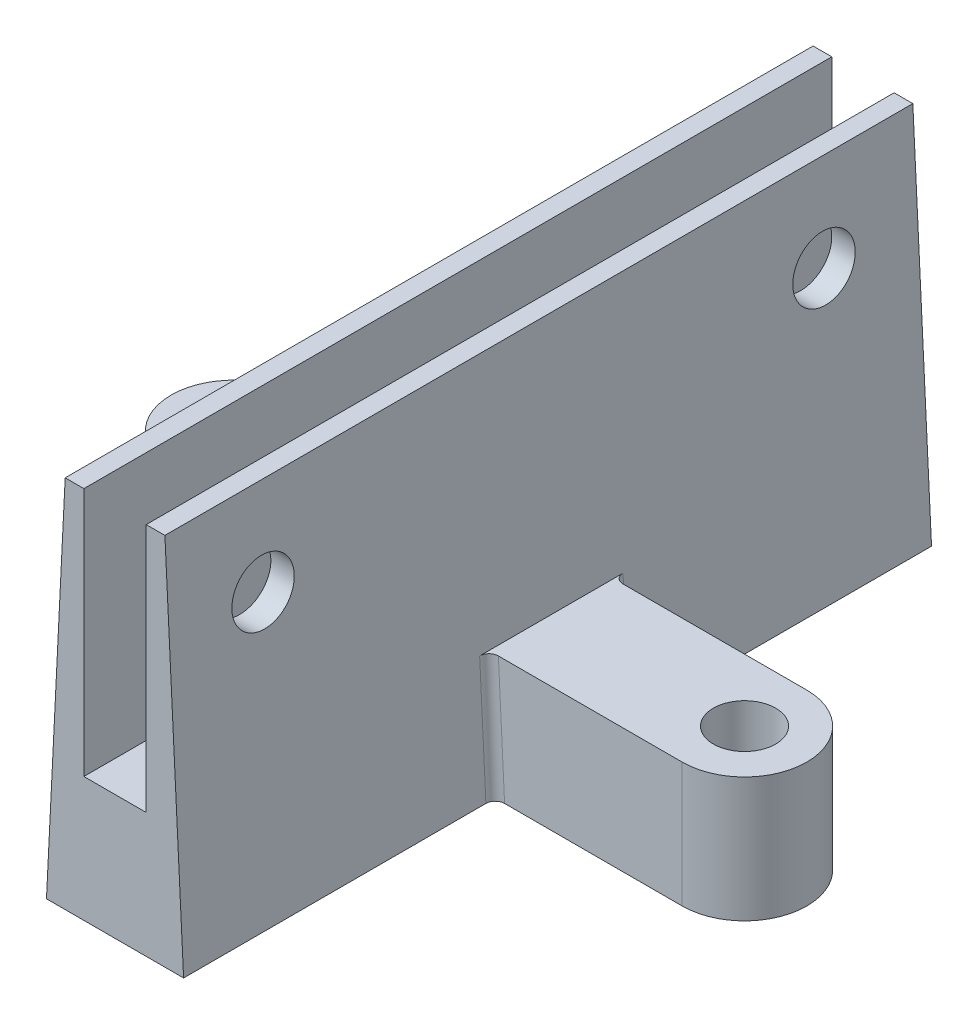
ISO-10303-21;
HEADER;
FILE_DESCRIPTION(('STEP AP214'),'2;1');
FILE_NAME('part.step','',(''),(''),'','','');
FILE_SCHEMA(('AUTOMOTIVE_DESIGN { 1 0 10303 214 1 1 1 1 }'));
ENDSEC;
DATA;
#1=APPLICATION_CONTEXT('core data for automotive mechanical design processes');
#2=APPLICATION_PROTOCOL_DEFINITION('international standard','automotive_design',2000,#1);
#3=PRODUCT_CONTEXT('',#1,'mechanical');
#4=PRODUCT('Part','Part','',(#3));
#5=PRODUCT_RELATED_PRODUCT_CATEGORY('part','',(#4));
#6=PRODUCT_DEFINITION_FORMATION('','',#4);
#7=PRODUCT_DEFINITION_CONTEXT('part definition',#1,'design');
#8=PRODUCT_DEFINITION('design','',#6,#7);
#9=PRODUCT_DEFINITION_SHAPE('','',#8);
#10=(LENGTH_UNIT() NAMED_UNIT(*) SI_UNIT(.MILLI.,.METRE.));
#11=(NAMED_UNIT(*) PLANE_ANGLE_UNIT() SI_UNIT($,.RADIAN.));
#12=(NAMED_UNIT(*) SI_UNIT($,.STERADIAN.) SOLID_ANGLE_UNIT());
#13=UNCERTAINTY_MEASURE_WITH_UNIT(LENGTH_MEASURE(1.E-05),#10,'distance_accuracy_value','');
#14=(GEOMETRIC_REPRESENTATION_CONTEXT(3) GLOBAL_UNCERTAINTY_ASSIGNED_CONTEXT((#13)) GLOBAL_UNIT_ASSIGNED_CONTEXT((#10,
#11,#12)) REPRESENTATION_CONTEXT('',''));
#15=CARTESIAN_POINT('',(0.,0.,0.));
#16=DIRECTION('',(0.,0.,1.));
#17=DIRECTION('',(1.,0.,0.));
#18=AXIS2_PLACEMENT_3D('',#15,#16,#17);
#19=CARTESIAN_POINT('',(0.,40.,-120.));
#20=DIRECTION('',(1.,0.,0.));
#21=DIRECTION('',(0.,0.,-1.));
#22=AXIS2_PLACEMENT_3D('',#19,#20,#21);
#23=PLANE('',#22);
#24=CARTESIAN_POINT('',(0.,25.,-15.));
#25=DIRECTION('',(1.,0.,0.));
#26=DIRECTION('',(0.,0.,-1.));
#27=AXIS2_PLACEMENT_3D('',#24,#25,#26);
#28=CIRCLE('',#27,5.);
#29=CARTESIAN_POINT('',(0.,25.,-20.));
#30=VERTEX_POINT('',#29);
#31=EDGE_CURVE('E431',#30,#30,#28,.F.);
#32=ORIENTED_EDGE('',*,*,#31,.T.);
#33=EDGE_LOOP('',(#32));
#34=FACE_BOUND('',#33,.T.);
#35=CARTESIAN_POINT('',(0.,25.,-105.));
#36=DIRECTION('',(1.,0.,0.));
#37=DIRECTION('',(0.,0.,-1.));
#38=AXIS2_PLACEMENT_3D('',#35,#36,#37);
#39=CIRCLE('',#38,5.);
#40=CARTESIAN_POINT('',(0.,25.,-110.));
#41=VERTEX_POINT('',#40);
#42=EDGE_CURVE('E417',#41,#41,#39,.F.);
#43=ORIENTED_EDGE('',*,*,#42,.T.);
#44=EDGE_LOOP('',(#43));
#45=FACE_BOUND('',#44,.T.);
#46=DIRECTION('',(0.,1.,0.));
#47=VECTOR('',#46,1.);
#48=CARTESIAN_POINT('',(0.,40.,0.));
#49=LINE('',#48,#47);
#50=CARTESIAN_POINT('',(0.,0.,0.));
#51=VERTEX_POINT('',#50);
#52=CARTESIAN_POINT('',(0.,40.,0.));
#53=VERTEX_POINT('',#52);
#54=EDGE_CURVE('E255',#51,#53,#49,.T.);
#55=ORIENTED_EDGE('',*,*,#54,.F.);
#56=DIRECTION('',(0.,0.,1.));
#57=VECTOR('',#56,1.);
#58=CARTESIAN_POINT('',(0.,0.,-120.));
#59=LINE('',#58,#57);
#60=CARTESIAN_POINT('',(0.,0.,-120.));
#61=VERTEX_POINT('',#60);
#62=EDGE_CURVE('E323',#61,#51,#59,.T.);
#63=ORIENTED_EDGE('',*,*,#62,.F.);
#64=DIRECTION('',(0.,1.,0.));
#65=VECTOR('',#64,1.);
#66=CARTESIAN_POINT('',(0.,40.,-120.));
#67=LINE('',#66,#65);
#68=CARTESIAN_POINT('',(0.,40.,-120.));
#69=VERTEX_POINT('',#68);
#70=EDGE_CURVE('E259',#61,#69,#67,.T.);
#71=ORIENTED_EDGE('',*,*,#70,.T.);
#72=DIRECTION('',(0.,0.,1.));
#73=VECTOR('',#72,1.);
#74=CARTESIAN_POINT('',(0.,40.,-120.));
#75=LINE('',#74,#73);
#76=EDGE_CURVE('E292',#69,#53,#75,.T.);
#77=ORIENTED_EDGE('',*,*,#76,.T.);
#78=EDGE_LOOP('',(#55,#63,#71,#77));
#79=FACE_BOUND('',#78,.T.);
#80=ADVANCED_FACE('F38',(#34,#45,#79),#23,.T.);
#81=CARTESIAN_POINT('',(0.,0.,-120.));
#82=DIRECTION('',(0.,1.,0.));
#83=DIRECTION('',(0.,0.,1.));
#84=AXIS2_PLACEMENT_3D('',#81,#82,#83);
#85=PLANE('',#84);
#86=DIRECTION('',(-1.,0.,0.));
#87=VECTOR('',#86,1.);
#88=CARTESIAN_POINT('',(0.,0.,0.));
#89=LINE('',#88,#87);
#90=CARTESIAN_POINT('',(10.,0.,0.));
#91=VERTEX_POINT('',#90);
#92=EDGE_CURVE('E264',#91,#51,#89,.T.);
#93=ORIENTED_EDGE('',*,*,#92,.F.);
#94=DIRECTION('',(0.,0.,1.));
#95=VECTOR('',#94,1.);
#96=CARTESIAN_POINT('',(10.,0.,-120.));
#97=LINE('',#96,#95);
#98=CARTESIAN_POINT('',(10.,0.,-120.));
#99=VERTEX_POINT('',#98);
#100=EDGE_CURVE('E327',#99,#91,#97,.T.);
#101=ORIENTED_EDGE('',*,*,#100,.F.);
#102=DIRECTION('',(-1.,0.,0.));
#103=VECTOR('',#102,1.);
#104=CARTESIAN_POINT('',(0.,0.,-120.));
#105=LINE('',#104,#103);
#106=EDGE_CURVE('E288',#99,#61,#105,.T.);
#107=ORIENTED_EDGE('',*,*,#106,.T.);
#108=ORIENTED_EDGE('',*,*,#62,.T.);
#109=EDGE_LOOP('',(#93,#101,#107,#108));
#110=FACE_BOUND('',#109,.T.);
#111=ADVANCED_FACE('F464',(#110),#85,.T.);
#112=CARTESIAN_POINT('',(10.,0.,-120.));
#113=DIRECTION('',(-1.,0.,0.));
#114=DIRECTION('',(0.,0.,1.));
#115=AXIS2_PLACEMENT_3D('',#112,#113,#114);
#116=PLANE('',#115);
#117=CARTESIAN_POINT('',(10.,25.,-15.));
#118=DIRECTION('',(-1.,0.,0.));
#119=DIRECTION('',(0.,0.,1.));
#120=AXIS2_PLACEMENT_3D('',#117,#118,#119);
#121=CIRCLE('',#120,5.);
#122=CARTESIAN_POINT('',(10.,25.,-10.));
#123=VERTEX_POINT('',#122);
#124=EDGE_CURVE('E427',#123,#123,#121,.F.);
#125=ORIENTED_EDGE('',*,*,#124,.T.);
#126=EDGE_LOOP('',(#125));
#127=FACE_BOUND('',#126,.T.);
#128=CARTESIAN_POINT('',(10.,25.,-105.));
#129=DIRECTION('',(-1.,0.,0.));
#130=DIRECTION('',(0.,0.,1.));
#131=AXIS2_PLACEMENT_3D('',#128,#129,#130);
#132=CIRCLE('',#131,5.);
#133=CARTESIAN_POINT('',(10.,25.,-100.));
#134=VERTEX_POINT('',#133);
#135=EDGE_CURVE('E411',#134,#134,#132,.F.);
#136=ORIENTED_EDGE('',*,*,#135,.T.);
#137=EDGE_LOOP('',(#136));
#138=FACE_BOUND('',#137,.T.);
#139=DIRECTION('',(0.,-1.,0.));
#140=VECTOR('',#139,1.);
#141=CARTESIAN_POINT('',(10.,0.,0.));
#142=LINE('',#141,#140);
#143=CARTESIAN_POINT('',(10.,40.,0.));
#144=VERTEX_POINT('',#143);
#145=EDGE_CURVE('E316',#144,#91,#142,.T.);
#146=ORIENTED_EDGE('',*,*,#145,.F.);
#147=DIRECTION('',(0.,0.,1.));
#148=VECTOR('',#147,1.);
#149=CARTESIAN_POINT('',(10.,40.,-120.));
#150=LINE('',#149,#148);
#151=CARTESIAN_POINT('',(10.,40.,-120.));
#152=VERTEX_POINT('',#151);
#153=EDGE_CURVE('E330',#152,#144,#150,.T.);
#154=ORIENTED_EDGE('',*,*,#153,.F.);
#155=DIRECTION('',(0.,-1.,0.));
#156=VECTOR('',#155,1.);
#157=CARTESIAN_POINT('',(10.,0.,-120.));
#158=LINE('',#157,#156);
#159=EDGE_CURVE('E284',#152,#99,#158,.T.);
#160=ORIENTED_EDGE('',*,*,#159,.T.);
#161=ORIENTED_EDGE('',*,*,#100,.T.);
#162=EDGE_LOOP('',(#146,#154,#160,#161));
#163=FACE_BOUND('',#162,.T.);
#164=ADVANCED_FACE('F472',(#127,#138,#163),#116,.T.);
#165=CARTESIAN_POINT('',(10.,40.,-120.));
#166=DIRECTION('',(0.,1.,0.));
#167=DIRECTION('',(0.,0.,1.));
#168=AXIS2_PLACEMENT_3D('',#165,#166,#167);
#169=PLANE('',#168);
#170=DIRECTION('',(-1.,0.,0.));
#171=VECTOR('',#170,1.);
#172=CARTESIAN_POINT('',(10.,40.,0.));
#173=LINE('',#172,#171);
#174=CARTESIAN_POINT('',(13.,40.,0.));
#175=VERTEX_POINT('',#174);
#176=EDGE_CURVE('E312',#175,#144,#173,.T.);
#177=ORIENTED_EDGE('',*,*,#176,.F.);
#178=DIRECTION('',(0.,0.,1.));
#179=VECTOR('',#178,1.);
#180=CARTESIAN_POINT('',(13.,40.,-120.));
#181=LINE('',#180,#179);
#182=CARTESIAN_POINT('',(13.,40.,-120.));
#183=VERTEX_POINT('',#182);
#184=EDGE_CURVE('E333',#183,#175,#181,.T.);
#185=ORIENTED_EDGE('',*,*,#184,.F.);
#186=DIRECTION('',(-1.,0.,0.));
#187=VECTOR('',#186,1.);
#188=CARTESIAN_POINT('',(10.,40.,-120.));
#189=LINE('',#188,#187);
#190=EDGE_CURVE('E280',#183,#152,#189,.T.);
#191=ORIENTED_EDGE('',*,*,#190,.T.);
#192=ORIENTED_EDGE('',*,*,#153,.T.);
#193=EDGE_LOOP('',(#177,#185,#191,#192));
#194=FACE_BOUND('',#193,.T.);
#195=ADVANCED_FACE('F459',(#194),#169,.T.);
#196=CARTESIAN_POINT('',(16.,-20.,-120.));
#197=DIRECTION('',(0.998752338877845,0.0499376169438923,0.));
#198=DIRECTION('',(-0.0499376169438923,0.998752338877845,0.));
#199=AXIS2_PLACEMENT_3D('',#196,#197,#198);
#200=PLANE('',#199);
#201=CARTESIAN_POINT('',(13.75,25.,-15.));
#202=DIRECTION('',(0.998752338877845,0.0499376169438923,0.));
#203=DIRECTION('',(-0.0499376169438923,0.998752338877845,0.));
#204=AXIS2_PLACEMENT_3D('',#201,#202,#203);
#205=ELLIPSE('',#204,5.0062460986252,5.);
#206=CARTESIAN_POINT('',(13.5,30.,-15.));
#207=VERTEX_POINT('',#206);
#208=EDGE_CURVE('E423',#207,#207,#205,.F.);
#209=ORIENTED_EDGE('',*,*,#208,.T.);
#210=EDGE_LOOP('',(#209));
#211=FACE_BOUND('',#210,.T.);
#212=CARTESIAN_POINT('',(13.75,25.,-105.));
#213=DIRECTION('',(0.998752338877845,0.0499376169438923,0.));
#214=DIRECTION('',(-0.0499376169438923,0.998752338877845,0.));
#215=AXIS2_PLACEMENT_3D('',#212,#213,#214);
#216=ELLIPSE('',#215,5.0062460986252,5.);
#217=CARTESIAN_POINT('',(13.5,30.,-105.));
#218=VERTEX_POINT('',#217);
#219=EDGE_CURVE('E406',#218,#218,#216,.F.);
#220=ORIENTED_EDGE('',*,*,#219,.T.);
#221=EDGE_LOOP('',(#220));
#222=FACE_BOUND('',#221,.T.);
#223=DIRECTION('',(0.,0.,-1.));
#224=VECTOR('',#223,1.);
#225=CARTESIAN_POINT('',(15.,0.,-120.));
#226=LINE('',#225,#224);
#227=CARTESIAN_POINT('',(15.,0.,-48.5));
#228=VERTEX_POINT('',#227);
#229=CARTESIAN_POINT('',(15.,0.,-71.5));
#230=VERTEX_POINT('',#229);
#231=EDGE_CURVE('E326',#228,#230,#226,.T.);
#232=ORIENTED_EDGE('',*,*,#231,.T.);
#233=DIRECTION('',(-0.0499376169438923,0.998752338877845,0.));
#234=VECTOR('',#233,1.);
#235=CARTESIAN_POINT('',(16.,-20.,-71.5));
#236=LINE('',#235,#234);
#237=CARTESIAN_POINT('',(16.,-20.,-71.5));
#238=VERTEX_POINT('',#237);
#239=EDGE_CURVE('E377',#230,#238,#236,.F.);
#240=ORIENTED_EDGE('',*,*,#239,.T.);
#241=DIRECTION('',(0.,0.,1.));
#242=VECTOR('',#241,1.);
#243=CARTESIAN_POINT('',(16.,-20.,-120.));
#244=LINE('',#243,#242);
#245=CARTESIAN_POINT('',(16.,-20.,-120.));
#246=VERTEX_POINT('',#245);
#247=EDGE_CURVE('E336',#246,#238,#244,.T.);
#248=ORIENTED_EDGE('',*,*,#247,.F.);
#249=DIRECTION('',(-0.0499376169438923,0.998752338877845,0.));
#250=VECTOR('',#249,1.);
#251=CARTESIAN_POINT('',(16.,-20.,-120.));
#252=LINE('',#251,#250);
#253=EDGE_CURVE('E276',#246,#183,#252,.T.);
#254=ORIENTED_EDGE('',*,*,#253,.T.);
#255=ORIENTED_EDGE('',*,*,#184,.T.);
#256=DIRECTION('',(-0.0499376169438923,0.998752338877845,0.));
#257=VECTOR('',#256,1.);
#258=CARTESIAN_POINT('',(16.,-20.,0.));
#259=LINE('',#258,#257);
#260=CARTESIAN_POINT('',(16.,-20.,0.));
#261=VERTEX_POINT('',#260);
#262=EDGE_CURVE('E308',#261,#175,#259,.T.);
#263=ORIENTED_EDGE('',*,*,#262,.F.);
#264=CARTESIAN_POINT('',(16.,-20.,-48.5));
#265=VERTEX_POINT('',#264);
#266=EDGE_CURVE('E340',#265,#261,#244,.T.);
#267=ORIENTED_EDGE('',*,*,#266,.F.);
#268=DIRECTION('',(0.0499376169438923,-0.998752338877845,0.));
#269=VECTOR('',#268,1.);
#270=CARTESIAN_POINT('',(15.,0.,-48.5));
#271=LINE('',#270,#269);
#272=EDGE_CURVE('E373',#265,#228,#271,.F.);
#273=ORIENTED_EDGE('',*,*,#272,.T.);
#274=EDGE_LOOP('',(#232,#240,#248,#254,#255,#263,#267,#273));
#275=FACE_BOUND('',#274,.T.);
#276=ADVANCED_FACE('F447',(#211,#222,#275),#200,.T.);
#277=CARTESIAN_POINT('',(-6.,-20.,-120.));
#278=DIRECTION('',(0.,-1.,0.));
#279=DIRECTION('',(0.,0.,-1.));
#280=AXIS2_PLACEMENT_3D('',#277,#278,#279);
#281=PLANE('',#280);
#282=DIRECTION('',(1.,0.,0.));
#283=VECTOR('',#282,1.);
#284=CARTESIAN_POINT('',(-6.,-20.,-70.));
#285=LINE('',#284,#283);
#286=CARTESIAN_POINT('',(-36.,-20.,-70.));
#287=VERTEX_POINT('',#286);
#288=CARTESIAN_POINT('',(-7.50187382958756,-20.,-70.));
#289=VERTEX_POINT('',#288);
#290=EDGE_CURVE('E190',#287,#289,#285,.T.);
#291=ORIENTED_EDGE('',*,*,#290,.T.);
#292=CARTESIAN_POINT('',(-7.50187382958756,-20.,-71.5));
#293=DIRECTION('',(0.,-1.,0.));
#294=DIRECTION('',(1.,0.,0.));
#295=AXIS2_PLACEMENT_3D('',#292,#293,#294);
#296=ELLIPSE('',#295,1.50187382958756,1.5);
#297=CARTESIAN_POINT('',(-6.,-20.,-71.5));
#298=VERTEX_POINT('',#297);
#299=EDGE_CURVE('E389',#289,#298,#296,.F.);
#300=ORIENTED_EDGE('',*,*,#299,.T.);
#301=DIRECTION('',(0.,0.,1.));
#302=VECTOR('',#301,1.);
#303=CARTESIAN_POINT('',(-6.,-20.,-120.));
#304=LINE('',#303,#302);
#305=CARTESIAN_POINT('',(-6.,-20.,-120.));
#306=VERTEX_POINT('',#305);
#307=EDGE_CURVE('E341',#306,#298,#304,.T.);
#308=ORIENTED_EDGE('',*,*,#307,.F.);
#309=DIRECTION('',(1.,0.,0.));
#310=VECTOR('',#309,1.);
#311=CARTESIAN_POINT('',(-6.,-20.,-120.));
#312=LINE('',#311,#310);
#313=EDGE_CURVE('E272',#306,#246,#312,.T.);
#314=ORIENTED_EDGE('',*,*,#313,.T.);
#315=ORIENTED_EDGE('',*,*,#247,.T.);
#316=CARTESIAN_POINT('',(17.5018738295876,-20.,-71.5));
#317=DIRECTION('',(0.,-1.,0.));
#318=DIRECTION('',(1.,0.,0.));
#319=AXIS2_PLACEMENT_3D('',#316,#317,#318);
#320=ELLIPSE('',#319,1.50187382958756,1.5);
#321=CARTESIAN_POINT('',(17.5018738295876,-20.,-70.));
#322=VERTEX_POINT('',#321);
#323=EDGE_CURVE('E399',#238,#322,#320,.F.);
#324=ORIENTED_EDGE('',*,*,#323,.T.);
#325=DIRECTION('',(1.,0.,0.));
#326=VECTOR('',#325,1.);
#327=CARTESIAN_POINT('',(16.,-20.,-70.));
#328=LINE('',#327,#326);
#329=CARTESIAN_POINT('',(46.,-20.,-70.));
#330=VERTEX_POINT('',#329);
#331=EDGE_CURVE('E227',#322,#330,#328,.T.);
#332=ORIENTED_EDGE('',*,*,#331,.T.);
#333=CARTESIAN_POINT('',(46.,-20.,-60.));
#334=DIRECTION('',(0.,-1.,0.));
#335=DIRECTION('',(0.,0.,-1.));
#336=AXIS2_PLACEMENT_3D('',#333,#334,#335);
#337=CIRCLE('',#336,9.99999999999999);
#338=CARTESIAN_POINT('',(46.,-20.,-50.));
#339=VERTEX_POINT('',#338);
#340=EDGE_CURVE('E245',#330,#339,#337,.T.);
#341=ORIENTED_EDGE('',*,*,#340,.T.);
#342=DIRECTION('',(-1.,0.,0.));
#343=VECTOR('',#342,1.);
#344=CARTESIAN_POINT('',(16.,-20.,-50.));
#345=LINE('',#344,#343);
#346=CARTESIAN_POINT('',(17.5018738295876,-20.,-50.));
#347=VERTEX_POINT('',#346);
#348=EDGE_CURVE('E235',#339,#347,#345,.T.);
#349=ORIENTED_EDGE('',*,*,#348,.T.);
#350=CARTESIAN_POINT('',(17.5018738295876,-20.,-48.5));
#351=DIRECTION('',(0.,-1.,0.));
#352=DIRECTION('',(-1.,0.,0.));
#353=AXIS2_PLACEMENT_3D('',#350,#351,#352);
#354=ELLIPSE('',#353,1.50187382958756,1.5);
#355=EDGE_CURVE('E48',#347,#265,#354,.F.);
#356=ORIENTED_EDGE('',*,*,#355,.T.);
#357=ORIENTED_EDGE('',*,*,#266,.T.);
#358=DIRECTION('',(1.,0.,0.));
#359=VECTOR('',#358,1.);
#360=CARTESIAN_POINT('',(-6.,-20.,0.));
#361=LINE('',#360,#359);
#362=CARTESIAN_POINT('',(-6.,-20.,0.));
#363=VERTEX_POINT('',#362);
#364=EDGE_CURVE('E304',#363,#261,#361,.T.);
#365=ORIENTED_EDGE('',*,*,#364,.F.);
#366=CARTESIAN_POINT('',(-6.,-20.,-48.5));
#367=VERTEX_POINT('',#366);
#368=EDGE_CURVE('E345',#367,#363,#304,.T.);
#369=ORIENTED_EDGE('',*,*,#368,.F.);
#370=CARTESIAN_POINT('',(-7.50187382958756,-20.,-48.5));
#371=DIRECTION('',(0.,-1.,0.));
#372=DIRECTION('',(-1.,0.,0.));
#373=AXIS2_PLACEMENT_3D('',#370,#371,#372);
#374=ELLIPSE('',#373,1.50187382958756,1.5);
#375=CARTESIAN_POINT('',(-7.50187382958756,-20.,-50.));
#376=VERTEX_POINT('',#375);
#377=EDGE_CURVE('E386',#367,#376,#374,.F.);
#378=ORIENTED_EDGE('',*,*,#377,.T.);
#379=DIRECTION('',(-1.,0.,0.));
#380=VECTOR('',#379,1.);
#381=CARTESIAN_POINT('',(-6.,-20.,-50.));
#382=LINE('',#381,#380);
#383=CARTESIAN_POINT('',(-36.,-20.,-50.));
#384=VERTEX_POINT('',#383);
#385=EDGE_CURVE('E211',#376,#384,#382,.T.);
#386=ORIENTED_EDGE('',*,*,#385,.T.);
#387=CARTESIAN_POINT('',(-36.,-20.,-60.));
#388=DIRECTION('',(0.,-1.,0.));
#389=DIRECTION('',(0.,0.,1.));
#390=AXIS2_PLACEMENT_3D('',#387,#388,#389);
#391=CIRCLE('',#390,9.99999999999999);
#392=EDGE_CURVE('E197',#384,#287,#391,.T.);
#393=ORIENTED_EDGE('',*,*,#392,.T.);
#394=EDGE_LOOP('',(#291,#300,#308,#314,#315,#324,#332,#341,#349,#356,#357,#365,#369,#378,#386,#393));
#395=FACE_BOUND('',#394,.T.);
#396=CARTESIAN_POINT('',(46.,-20.,-60.));
#397=DIRECTION('',(0.,-1.,0.));
#398=DIRECTION('',(0.,0.,-1.));
#399=AXIS2_PLACEMENT_3D('',#396,#397,#398);
#400=CIRCLE('',#399,5.);
#401=CARTESIAN_POINT('',(46.,-20.,-65.));
#402=VERTEX_POINT('',#401);
#403=EDGE_CURVE('E221',#402,#402,#400,.T.);
#404=ORIENTED_EDGE('',*,*,#403,.F.);
#405=EDGE_LOOP('',(#404));
#406=FACE_BOUND('',#405,.T.);
#407=CARTESIAN_POINT('',(-36.,-20.,-60.));
#408=DIRECTION('',(0.,-1.,0.));
#409=DIRECTION('',(0.,0.,-1.));
#410=AXIS2_PLACEMENT_3D('',#407,#408,#409);
#411=CIRCLE('',#410,5.);
#412=CARTESIAN_POINT('',(-36.,-20.,-65.));
#413=VERTEX_POINT('',#412);
#414=EDGE_CURVE('E435',#413,#413,#411,.T.);
#415=ORIENTED_EDGE('',*,*,#414,.F.);
#416=EDGE_LOOP('',(#415));
#417=FACE_BOUND('',#416,.T.);
#418=ADVANCED_FACE('F444',(#395,#406,#417),#281,.T.);
#419=CARTESIAN_POINT('',(-6.,-20.,-120.));
#420=DIRECTION('',(-0.998752338877845,0.0499376169438922,0.));
#421=DIRECTION('',(-0.0499376169438922,-0.998752338877845,0.));
#422=AXIS2_PLACEMENT_3D('',#419,#420,#421);
#423=PLANE('',#422);
#424=CARTESIAN_POINT('',(-3.75,25.,-15.));
#425=DIRECTION('',(-0.998752338877845,0.0499376169438922,0.));
#426=DIRECTION('',(-0.0499376169438922,-0.998752338877845,0.));
#427=AXIS2_PLACEMENT_3D('',#424,#425,#426);
#428=ELLIPSE('',#427,5.0062460986252,5.);
#429=CARTESIAN_POINT('',(-4.,20.,-15.));
#430=VERTEX_POINT('',#429);
#431=EDGE_CURVE('E42',#430,#430,#428,.F.);
#432=ORIENTED_EDGE('',*,*,#431,.T.);
#433=EDGE_LOOP('',(#432));
#434=FACE_BOUND('',#433,.T.);
#435=CARTESIAN_POINT('',(-3.75,25.,-105.));
#436=DIRECTION('',(-0.998752338877845,0.0499376169438922,0.));
#437=DIRECTION('',(-0.0499376169438922,-0.998752338877845,0.));
#438=AXIS2_PLACEMENT_3D('',#435,#436,#437);
#439=ELLIPSE('',#438,5.0062460986252,5.);
#440=CARTESIAN_POINT('',(-4.,20.,-105.));
#441=VERTEX_POINT('',#440);
#442=EDGE_CURVE('E403',#441,#441,#439,.F.);
#443=ORIENTED_EDGE('',*,*,#442,.T.);
#444=EDGE_LOOP('',(#443));
#445=FACE_BOUND('',#444,.T.);
#446=DIRECTION('',(0.,0.,-1.));
#447=VECTOR('',#446,1.);
#448=CARTESIAN_POINT('',(-5.,0.,-120.));
#449=LINE('',#448,#447);
#450=CARTESIAN_POINT('',(-5.,0.,-48.5));
#451=VERTEX_POINT('',#450);
#452=CARTESIAN_POINT('',(-5.,0.,-71.5));
#453=VERTEX_POINT('',#452);
#454=EDGE_CURVE('E353',#451,#453,#449,.T.);
#455=ORIENTED_EDGE('',*,*,#454,.F.);
#456=DIRECTION('',(0.0499376169438922,0.998752338877845,0.));
#457=VECTOR('',#456,1.);
#458=CARTESIAN_POINT('',(-6.,-20.,-48.5));
#459=LINE('',#458,#457);
#460=EDGE_CURVE('E362',#451,#367,#459,.F.);
#461=ORIENTED_EDGE('',*,*,#460,.T.);
#462=ORIENTED_EDGE('',*,*,#368,.T.);
#463=DIRECTION('',(-0.0499376169438922,-0.998752338877845,0.));
#464=VECTOR('',#463,1.);
#465=CARTESIAN_POINT('',(-6.,-20.,0.));
#466=LINE('',#465,#464);
#467=CARTESIAN_POINT('',(-3.,40.,0.));
#468=VERTEX_POINT('',#467);
#469=EDGE_CURVE('E300',#468,#363,#466,.T.);
#470=ORIENTED_EDGE('',*,*,#469,.F.);
#471=DIRECTION('',(0.,0.,1.));
#472=VECTOR('',#471,1.);
#473=CARTESIAN_POINT('',(-3.,40.,-120.));
#474=LINE('',#473,#472);
#475=CARTESIAN_POINT('',(-3.,40.,-120.));
#476=VERTEX_POINT('',#475);
#477=EDGE_CURVE('E346',#476,#468,#474,.T.);
#478=ORIENTED_EDGE('',*,*,#477,.F.);
#479=DIRECTION('',(-0.0499376169438922,-0.998752338877845,0.));
#480=VECTOR('',#479,1.);
#481=CARTESIAN_POINT('',(-6.,-20.,-120.));
#482=LINE('',#481,#480);
#483=EDGE_CURVE('E268',#476,#306,#482,.T.);
#484=ORIENTED_EDGE('',*,*,#483,.T.);
#485=ORIENTED_EDGE('',*,*,#307,.T.);
#486=DIRECTION('',(-0.0499376169438922,-0.998752338877845,0.));
#487=VECTOR('',#486,1.);
#488=CARTESIAN_POINT('',(-5.,0.,-71.5));
#489=LINE('',#488,#487);
#490=EDGE_CURVE('E358',#298,#453,#489,.F.);
#491=ORIENTED_EDGE('',*,*,#490,.T.);
#492=EDGE_LOOP('',(#455,#461,#462,#470,#478,#484,#485,#491));
#493=FACE_BOUND('',#492,.T.);
#494=ADVANCED_FACE('F446',(#434,#445,#493),#423,.T.);
#495=CARTESIAN_POINT('',(-3.,40.,-120.));
#496=DIRECTION('',(0.,1.,0.));
#497=DIRECTION('',(-1.,0.,0.));
#498=AXIS2_PLACEMENT_3D('',#495,#496,#497);
#499=PLANE('',#498);
#500=DIRECTION('',(-1.,0.,0.));
#501=VECTOR('',#500,1.);
#502=CARTESIAN_POINT('',(-3.,40.,0.));
#503=LINE('',#502,#501);
#504=EDGE_CURVE('E296',#53,#468,#503,.T.);
#505=ORIENTED_EDGE('',*,*,#504,.F.);
#506=ORIENTED_EDGE('',*,*,#76,.F.);
#507=DIRECTION('',(-1.,0.,0.));
#508=VECTOR('',#507,1.);
#509=CARTESIAN_POINT('',(-3.,40.,-120.));
#510=LINE('',#509,#508);
#511=EDGE_CURVE('E263',#69,#476,#510,.T.);
#512=ORIENTED_EDGE('',*,*,#511,.T.);
#513=ORIENTED_EDGE('',*,*,#477,.T.);
#514=EDGE_LOOP('',(#505,#506,#512,#513));
#515=FACE_BOUND('',#514,.T.);
#516=ADVANCED_FACE('F455',(#515),#499,.T.);
#517=CARTESIAN_POINT('',(0.,0.,-120.));
#518=DIRECTION('',(0.,0.,1.));
#519=DIRECTION('',(1.,0.,0.));
#520=AXIS2_PLACEMENT_3D('',#517,#518,#519);
#521=PLANE('',#520);
#522=ORIENTED_EDGE('',*,*,#70,.F.);
#523=ORIENTED_EDGE('',*,*,#106,.F.);
#524=ORIENTED_EDGE('',*,*,#159,.F.);
#525=ORIENTED_EDGE('',*,*,#190,.F.);
#526=ORIENTED_EDGE('',*,*,#253,.F.);
#527=ORIENTED_EDGE('',*,*,#313,.F.);
#528=ORIENTED_EDGE('',*,*,#483,.F.);
#529=ORIENTED_EDGE('',*,*,#511,.F.);
#530=EDGE_LOOP('',(#522,#523,#524,#525,#526,#527,#528,#529));
#531=FACE_BOUND('',#530,.T.);
#532=ADVANCED_FACE('F529',(#531),#521,.F.);
#533=CARTESIAN_POINT('',(0.,0.,0.));
#534=DIRECTION('',(0.,0.,1.));
#535=DIRECTION('',(1.,0.,0.));
#536=AXIS2_PLACEMENT_3D('',#533,#534,#535);
#537=PLANE('',#536);
#538=ORIENTED_EDGE('',*,*,#54,.T.);
#539=ORIENTED_EDGE('',*,*,#504,.T.);
#540=ORIENTED_EDGE('',*,*,#469,.T.);
#541=ORIENTED_EDGE('',*,*,#364,.T.);
#542=ORIENTED_EDGE('',*,*,#262,.T.);
#543=ORIENTED_EDGE('',*,*,#176,.T.);
#544=ORIENTED_EDGE('',*,*,#145,.T.);
#545=ORIENTED_EDGE('',*,*,#92,.T.);
#546=EDGE_LOOP('',(#538,#539,#540,#541,#542,#543,#544,#545));
#547=FACE_BOUND('',#546,.T.);
#548=ADVANCED_FACE('F520',(#547),#537,.T.);
#549=CARTESIAN_POINT('',(16.,0.,-50.));
#550=DIRECTION('',(0.,0.,1.));
#551=DIRECTION('',(1.,0.,0.));
#552=AXIS2_PLACEMENT_3D('',#549,#550,#551);
#553=PLANE('',#552);
#554=DIRECTION('',(-1.,0.,0.));
#555=VECTOR('',#554,1.);
#556=CARTESIAN_POINT('',(16.,0.,-50.));
#557=LINE('',#556,#555);
#558=CARTESIAN_POINT('',(46.,0.,-50.));
#559=VERTEX_POINT('',#558);
#560=CARTESIAN_POINT('',(16.5018738295876,0.,-50.));
#561=VERTEX_POINT('',#560);
#562=EDGE_CURVE('E231',#559,#561,#557,.T.);
#563=ORIENTED_EDGE('',*,*,#562,.T.);
#564=DIRECTION('',(0.0499376169438923,-0.998752338877845,0.));
#565=VECTOR('',#564,1.);
#566=CARTESIAN_POINT('',(17.4981285083168,-19.9250935745842,-50.));
#567=LINE('',#566,#565);
#568=EDGE_CURVE('E380',#561,#347,#567,.T.);
#569=ORIENTED_EDGE('',*,*,#568,.T.);
#570=ORIENTED_EDGE('',*,*,#348,.F.);
#571=DIRECTION('',(0.,-1.,0.));
#572=VECTOR('',#571,1.);
#573=CARTESIAN_POINT('',(46.,0.,-50.));
#574=LINE('',#573,#572);
#575=EDGE_CURVE('E252',#559,#339,#574,.T.);
#576=ORIENTED_EDGE('',*,*,#575,.F.);
#577=EDGE_LOOP('',(#563,#569,#570,#576));
#578=FACE_BOUND('',#577,.T.);
#579=ADVANCED_FACE('F507',(#578),#553,.T.);
#580=CARTESIAN_POINT('',(46.,0.,-60.));
#581=DIRECTION('',(0.,-1.,0.));
#582=DIRECTION('',(0.,0.,-1.));
#583=AXIS2_PLACEMENT_3D('',#580,#581,#582);
#584=CYLINDRICAL_SURFACE('',#583,9.99999999999999);
#585=ORIENTED_EDGE('',*,*,#340,.F.);
#586=DIRECTION('',(0.,-1.,0.));
#587=VECTOR('',#586,1.);
#588=CARTESIAN_POINT('',(46.,0.,-70.));
#589=LINE('',#588,#587);
#590=CARTESIAN_POINT('',(46.,0.,-70.));
#591=VERTEX_POINT('',#590);
#592=EDGE_CURVE('E242',#591,#330,#589,.T.);
#593=ORIENTED_EDGE('',*,*,#592,.F.);
#594=CARTESIAN_POINT('',(46.,0.,-60.));
#595=DIRECTION('',(0.,-1.,0.));
#596=DIRECTION('',(0.,0.,-1.));
#597=AXIS2_PLACEMENT_3D('',#594,#595,#596);
#598=CIRCLE('',#597,9.99999999999999);
#599=EDGE_CURVE('E238',#591,#559,#598,.T.);
#600=ORIENTED_EDGE('',*,*,#599,.T.);
#601=ORIENTED_EDGE('',*,*,#575,.T.);
#602=EDGE_LOOP('',(#585,#593,#600,#601));
#603=FACE_BOUND('',#602,.T.);
#604=ADVANCED_FACE('F503',(#603),#584,.T.);
#605=CARTESIAN_POINT('',(16.,0.,-70.));
#606=DIRECTION('',(0.,0.,-1.));
#607=DIRECTION('',(-1.,0.,0.));
#608=AXIS2_PLACEMENT_3D('',#605,#606,#607);
#609=PLANE('',#608);
#610=ORIENTED_EDGE('',*,*,#331,.F.);
#611=DIRECTION('',(-0.0499376169438923,0.998752338877845,0.));
#612=VECTOR('',#611,1.);
#613=CARTESIAN_POINT('',(16.4981285083168,0.0749064254158351,-70.));
#614=LINE('',#613,#612);
#615=CARTESIAN_POINT('',(16.5018738295876,0.,-70.));
#616=VERTEX_POINT('',#615);
#617=EDGE_CURVE('E369',#322,#616,#614,.T.);
#618=ORIENTED_EDGE('',*,*,#617,.T.);
#619=DIRECTION('',(1.,0.,0.));
#620=VECTOR('',#619,1.);
#621=CARTESIAN_POINT('',(16.,0.,-70.));
#622=LINE('',#621,#620);
#623=EDGE_CURVE('E234',#616,#591,#622,.T.);
#624=ORIENTED_EDGE('',*,*,#623,.T.);
#625=ORIENTED_EDGE('',*,*,#592,.T.);
#626=EDGE_LOOP('',(#610,#618,#624,#625));
#627=FACE_BOUND('',#626,.T.);
#628=ADVANCED_FACE('F497',(#627),#609,.T.);
#629=CARTESIAN_POINT('',(46.,0.,-60.));
#630=DIRECTION('',(0.,-1.,0.));
#631=DIRECTION('',(0.,0.,-1.));
#632=AXIS2_PLACEMENT_3D('',#629,#630,#631);
#633=PLANE('',#632);
#634=ORIENTED_EDGE('',*,*,#231,.F.);
#635=CARTESIAN_POINT('',(16.5018738295876,0.,-48.5));
#636=DIRECTION('',(0.,-1.,0.));
#637=DIRECTION('',(-1.,0.,0.));
#638=AXIS2_PLACEMENT_3D('',#635,#636,#637);
#639=ELLIPSE('',#638,1.50187382958756,1.5);
#640=EDGE_CURVE('E11',#228,#561,#639,.T.);
#641=ORIENTED_EDGE('',*,*,#640,.T.);
#642=ORIENTED_EDGE('',*,*,#562,.F.);
#643=ORIENTED_EDGE('',*,*,#599,.F.);
#644=ORIENTED_EDGE('',*,*,#623,.F.);
#645=CARTESIAN_POINT('',(16.5018738295876,0.,-71.5));
#646=DIRECTION('',(0.,-1.,0.));
#647=DIRECTION('',(1.,0.,0.));
#648=AXIS2_PLACEMENT_3D('',#645,#646,#647);
#649=ELLIPSE('',#648,1.50187382958756,1.5);
#650=EDGE_CURVE('E395',#616,#230,#649,.T.);
#651=ORIENTED_EDGE('',*,*,#650,.T.);
#652=EDGE_LOOP('',(#634,#641,#642,#643,#644,#651));
#653=FACE_BOUND('',#652,.T.);
#654=CARTESIAN_POINT('',(46.,0.,-60.));
#655=DIRECTION('',(0.,-1.,0.));
#656=DIRECTION('',(0.,0.,-1.));
#657=AXIS2_PLACEMENT_3D('',#654,#655,#656);
#658=CIRCLE('',#657,5.);
#659=CARTESIAN_POINT('',(46.,0.,-65.));
#660=VERTEX_POINT('',#659);
#661=EDGE_CURVE('E223',#660,#660,#658,.T.);
#662=ORIENTED_EDGE('',*,*,#661,.T.);
#663=EDGE_LOOP('',(#662));
#664=FACE_BOUND('',#663,.T.);
#665=ADVANCED_FACE('F545',(#653,#664),#633,.F.);
#666=CARTESIAN_POINT('',(46.,0.,-60.));
#667=DIRECTION('',(0.,-1.,0.));
#668=DIRECTION('',(0.,0.,-1.));
#669=AXIS2_PLACEMENT_3D('',#666,#667,#668);
#670=CYLINDRICAL_SURFACE('',#669,5.);
#671=ORIENTED_EDGE('',*,*,#661,.F.);
#672=EDGE_LOOP('',(#671));
#673=FACE_BOUND('',#672,.T.);
#674=ORIENTED_EDGE('',*,*,#403,.T.);
#675=EDGE_LOOP('',(#674));
#676=FACE_BOUND('',#675,.T.);
#677=ADVANCED_FACE('F538',(#673,#676),#670,.F.);
#678=CARTESIAN_POINT('',(-6.,0.,-70.));
#679=DIRECTION('',(0.,0.,-1.));
#680=DIRECTION('',(-1.,0.,0.));
#681=AXIS2_PLACEMENT_3D('',#678,#679,#680);
#682=PLANE('',#681);
#683=DIRECTION('',(1.,0.,0.));
#684=VECTOR('',#683,1.);
#685=CARTESIAN_POINT('',(-6.,0.,-70.));
#686=LINE('',#685,#684);
#687=CARTESIAN_POINT('',(-36.,0.,-70.));
#688=VERTEX_POINT('',#687);
#689=CARTESIAN_POINT('',(-6.50187382958756,0.,-70.));
#690=VERTEX_POINT('',#689);
#691=EDGE_CURVE('E200',#688,#690,#686,.T.);
#692=ORIENTED_EDGE('',*,*,#691,.T.);
#693=DIRECTION('',(-0.0499376169438922,-0.998752338877845,0.));
#694=VECTOR('',#693,1.);
#695=CARTESIAN_POINT('',(-7.49812850831677,-19.9250935745842,-70.));
#696=LINE('',#695,#694);
#697=EDGE_CURVE('E365',#690,#289,#696,.T.);
#698=ORIENTED_EDGE('',*,*,#697,.T.);
#699=ORIENTED_EDGE('',*,*,#290,.F.);
#700=DIRECTION('',(0.,-1.,0.));
#701=VECTOR('',#700,1.);
#702=CARTESIAN_POINT('',(-36.,0.,-70.));
#703=LINE('',#702,#701);
#704=EDGE_CURVE('E199',#688,#287,#703,.T.);
#705=ORIENTED_EDGE('',*,*,#704,.F.);
#706=EDGE_LOOP('',(#692,#698,#699,#705));
#707=FACE_BOUND('',#706,.T.);
#708=ADVANCED_FACE('F536',(#707),#682,.T.);
#709=CARTESIAN_POINT('',(-36.,0.,-60.));
#710=DIRECTION('',(0.,-1.,0.));
#711=DIRECTION('',(0.,0.,-1.));
#712=AXIS2_PLACEMENT_3D('',#709,#710,#711);
#713=CYLINDRICAL_SURFACE('',#712,9.99999999999999);
#714=ORIENTED_EDGE('',*,*,#392,.F.);
#715=DIRECTION('',(0.,-1.,0.));
#716=VECTOR('',#715,1.);
#717=CARTESIAN_POINT('',(-36.,0.,-50.));
#718=LINE('',#717,#716);
#719=CARTESIAN_POINT('',(-36.,0.,-50.));
#720=VERTEX_POINT('',#719);
#721=EDGE_CURVE('E181',#720,#384,#718,.T.);
#722=ORIENTED_EDGE('',*,*,#721,.F.);
#723=CARTESIAN_POINT('',(-36.,0.,-60.));
#724=DIRECTION('',(0.,-1.,0.));
#725=DIRECTION('',(0.,0.,1.));
#726=AXIS2_PLACEMENT_3D('',#723,#724,#725);
#727=CIRCLE('',#726,9.99999999999999);
#728=EDGE_CURVE('E189',#720,#688,#727,.T.);
#729=ORIENTED_EDGE('',*,*,#728,.T.);
#730=ORIENTED_EDGE('',*,*,#704,.T.);
#731=EDGE_LOOP('',(#714,#722,#729,#730));
#732=FACE_BOUND('',#731,.T.);
#733=ADVANCED_FACE('F194',(#732),#713,.T.);
#734=CARTESIAN_POINT('',(-6.,0.,-50.));
#735=DIRECTION('',(0.,0.,1.));
#736=DIRECTION('',(1.,0.,0.));
#737=AXIS2_PLACEMENT_3D('',#734,#735,#736);
#738=PLANE('',#737);
#739=ORIENTED_EDGE('',*,*,#385,.F.);
#740=DIRECTION('',(0.0499376169438922,0.998752338877845,0.));
#741=VECTOR('',#740,1.);
#742=CARTESIAN_POINT('',(-6.49812850831677,0.0749064254158349,-50.));
#743=LINE('',#742,#741);
#744=CARTESIAN_POINT('',(-6.50187382958756,0.,-50.));
#745=VERTEX_POINT('',#744);
#746=EDGE_CURVE('E184',#376,#745,#743,.T.);
#747=ORIENTED_EDGE('',*,*,#746,.T.);
#748=DIRECTION('',(-1.,0.,0.));
#749=VECTOR('',#748,1.);
#750=CARTESIAN_POINT('',(-6.,0.,-50.));
#751=LINE('',#750,#749);
#752=EDGE_CURVE('E177',#745,#720,#751,.T.);
#753=ORIENTED_EDGE('',*,*,#752,.T.);
#754=ORIENTED_EDGE('',*,*,#721,.T.);
#755=EDGE_LOOP('',(#739,#747,#753,#754));
#756=FACE_BOUND('',#755,.T.);
#757=ADVANCED_FACE('F180',(#756),#738,.T.);
#758=CARTESIAN_POINT('',(-36.,0.,-60.));
#759=DIRECTION('',(0.,1.,0.));
#760=DIRECTION('',(0.,0.,1.));
#761=AXIS2_PLACEMENT_3D('',#758,#759,#760);
#762=PLANE('',#761);
#763=CARTESIAN_POINT('',(-36.,0.,-60.));
#764=DIRECTION('',(0.,-1.,0.));
#765=DIRECTION('',(0.,0.,-1.));
#766=AXIS2_PLACEMENT_3D('',#763,#764,#765);
#767=CIRCLE('',#766,5.);
#768=CARTESIAN_POINT('',(-36.,0.,-65.));
#769=VERTEX_POINT('',#768);
#770=EDGE_CURVE('E214',#769,#769,#767,.T.);
#771=ORIENTED_EDGE('',*,*,#770,.T.);
#772=EDGE_LOOP('',(#771));
#773=FACE_BOUND('',#772,.T.);
#774=ORIENTED_EDGE('',*,*,#752,.F.);
#775=CARTESIAN_POINT('',(-6.50187382958756,0.,-48.5));
#776=DIRECTION('',(0.,1.,0.));
#777=DIRECTION('',(-1.,0.,0.));
#778=AXIS2_PLACEMENT_3D('',#775,#776,#777);
#779=ELLIPSE('',#778,1.50187382958756,1.5);
#780=EDGE_CURVE('E383',#745,#451,#779,.F.);
#781=ORIENTED_EDGE('',*,*,#780,.T.);
#782=ORIENTED_EDGE('',*,*,#454,.T.);
#783=CARTESIAN_POINT('',(-6.50187382958756,0.,-71.5));
#784=DIRECTION('',(0.,1.,0.));
#785=DIRECTION('',(1.,0.,0.));
#786=AXIS2_PLACEMENT_3D('',#783,#784,#785);
#787=ELLIPSE('',#786,1.50187382958756,1.5);
#788=EDGE_CURVE('E392',#453,#690,#787,.F.);
#789=ORIENTED_EDGE('',*,*,#788,.T.);
#790=ORIENTED_EDGE('',*,*,#691,.F.);
#791=ORIENTED_EDGE('',*,*,#728,.F.);
#792=EDGE_LOOP('',(#774,#781,#782,#789,#790,#791));
#793=FACE_BOUND('',#792,.T.);
#794=ADVANCED_FACE('F203',(#773,#793),#762,.T.);
#795=CARTESIAN_POINT('',(-36.,0.,-60.));
#796=DIRECTION('',(0.,-1.,0.));
#797=DIRECTION('',(0.,0.,-1.));
#798=AXIS2_PLACEMENT_3D('',#795,#796,#797);
#799=CYLINDRICAL_SURFACE('',#798,5.);
#800=ORIENTED_EDGE('',*,*,#770,.F.);
#801=EDGE_LOOP('',(#800));
#802=FACE_BOUND('',#801,.T.);
#803=ORIENTED_EDGE('',*,*,#414,.T.);
#804=EDGE_LOOP('',(#803));
#805=FACE_BOUND('',#804,.T.);
#806=ADVANCED_FACE('F442',(#802,#805),#799,.F.);
#807=CARTESIAN_POINT('',(-6.5006222739028,0.0250311136951367,-48.5));
#808=DIRECTION('',(-0.0499376169438922,-0.998752338877845,0.));
#809=DIRECTION('',(0.998752338877845,-0.0499376169438922,0.));
#810=AXIS2_PLACEMENT_3D('',#807,#808,#809);
#811=CYLINDRICAL_SURFACE('',#810,1.5);
#812=ORIENTED_EDGE('',*,*,#377,.F.);
#813=ORIENTED_EDGE('',*,*,#460,.F.);
#814=ORIENTED_EDGE('',*,*,#780,.F.);
#815=ORIENTED_EDGE('',*,*,#746,.F.);
#816=EDGE_LOOP('',(#812,#813,#814,#815));
#817=FACE_BOUND('',#816,.T.);
#818=ADVANCED_FACE('F478',(#817),#811,.F.);
#819=CARTESIAN_POINT('',(-6.5006222739028,0.0250311136951367,-71.5));
#820=DIRECTION('',(0.0499376169438922,0.998752338877845,0.));
#821=DIRECTION('',(-0.998752338877845,0.0499376169438922,0.));
#822=AXIS2_PLACEMENT_3D('',#819,#820,#821);
#823=CYLINDRICAL_SURFACE('',#822,1.5);
#824=ORIENTED_EDGE('',*,*,#788,.F.);
#825=ORIENTED_EDGE('',*,*,#490,.F.);
#826=ORIENTED_EDGE('',*,*,#299,.F.);
#827=ORIENTED_EDGE('',*,*,#697,.F.);
#828=EDGE_LOOP('',(#824,#825,#826,#827));
#829=FACE_BOUND('',#828,.T.);
#830=ADVANCED_FACE('F481',(#829),#823,.F.);
#831=CARTESIAN_POINT('',(16.5006222739028,0.0250311136951367,-71.5));
#832=DIRECTION('',(0.0499376169438923,-0.998752338877845,0.));
#833=DIRECTION('',(0.998752338877845,0.0499376169438923,0.));
#834=AXIS2_PLACEMENT_3D('',#831,#832,#833);
#835=CYLINDRICAL_SURFACE('',#834,1.5);
#836=ORIENTED_EDGE('',*,*,#323,.F.);
#837=ORIENTED_EDGE('',*,*,#239,.F.);
#838=ORIENTED_EDGE('',*,*,#650,.F.);
#839=ORIENTED_EDGE('',*,*,#617,.F.);
#840=EDGE_LOOP('',(#836,#837,#838,#839));
#841=FACE_BOUND('',#840,.T.);
#842=ADVANCED_FACE('F484',(#841),#835,.F.);
#843=CARTESIAN_POINT('',(16.5006222739028,0.0250311136951367,-48.5));
#844=DIRECTION('',(-0.0499376169438923,0.998752338877845,0.));
#845=DIRECTION('',(-0.998752338877845,-0.0499376169438923,0.));
#846=AXIS2_PLACEMENT_3D('',#843,#844,#845);
#847=CYLINDRICAL_SURFACE('',#846,1.5);
#848=ORIENTED_EDGE('',*,*,#640,.F.);
#849=ORIENTED_EDGE('',*,*,#272,.F.);
#850=ORIENTED_EDGE('',*,*,#355,.F.);
#851=ORIENTED_EDGE('',*,*,#568,.F.);
#852=EDGE_LOOP('',(#848,#849,#850,#851));
#853=FACE_BOUND('',#852,.T.);
#854=ADVANCED_FACE('F40',(#853),#847,.F.);
#855=CARTESIAN_POINT('',(56.,25.,-105.));
#856=DIRECTION('',(-1.,0.,0.));
#857=DIRECTION('',(0.,0.,1.));
#858=AXIS2_PLACEMENT_3D('',#855,#856,#857);
#859=CYLINDRICAL_SURFACE('',#858,5.);
#860=ORIENTED_EDGE('',*,*,#42,.F.);
#861=EDGE_LOOP('',(#860));
#862=FACE_BOUND('',#861,.T.);
#863=ORIENTED_EDGE('',*,*,#442,.F.);
#864=EDGE_LOOP('',(#863));
#865=FACE_BOUND('',#864,.T.);
#866=ADVANCED_FACE('F491',(#862,#865),#859,.F.);
#867=CARTESIAN_POINT('',(56.,25.,-15.));
#868=DIRECTION('',(-1.,0.,0.));
#869=DIRECTION('',(0.,0.,1.));
#870=AXIS2_PLACEMENT_3D('',#867,#868,#869);
#871=CYLINDRICAL_SURFACE('',#870,5.);
#872=ORIENTED_EDGE('',*,*,#31,.F.);
#873=EDGE_LOOP('',(#872));
#874=FACE_BOUND('',#873,.T.);
#875=ORIENTED_EDGE('',*,*,#431,.F.);
#876=EDGE_LOOP('',(#875));
#877=FACE_BOUND('',#876,.T.);
#878=ADVANCED_FACE('F601',(#874,#877),#871,.F.);
#879=ORIENTED_EDGE('',*,*,#135,.F.);
#880=EDGE_LOOP('',(#879));
#881=FACE_BOUND('',#880,.T.);
#882=ORIENTED_EDGE('',*,*,#219,.F.);
#883=EDGE_LOOP('',(#882));
#884=FACE_BOUND('',#883,.T.);
#885=ADVANCED_FACE('F604',(#881,#884),#859,.F.);
#886=ORIENTED_EDGE('',*,*,#124,.F.);
#887=EDGE_LOOP('',(#886));
#888=FACE_BOUND('',#887,.T.);
#889=ORIENTED_EDGE('',*,*,#208,.F.);
#890=EDGE_LOOP('',(#889));
#891=FACE_BOUND('',#890,.T.);
#892=ADVANCED_FACE('F615',(#888,#891),#871,.F.);
#893=CLOSED_SHELL('',(#80,#111,#164,#195,#276,#418,#494,#516,#532,#548,#579,#604,#628,#665,#677,
#708,#733,#757,#794,#806,#818,#830,#842,#854,#866,#878,#885,#892));
#894=MANIFOLD_SOLID_BREP('B2',#893);
#895=ADVANCED_BREP_SHAPE_REPRESENTATION('',(#18,#894),#14);
#896=SHAPE_DEFINITION_REPRESENTATION(#9,#895);
ENDSEC;
END-ISO-10303-21;
